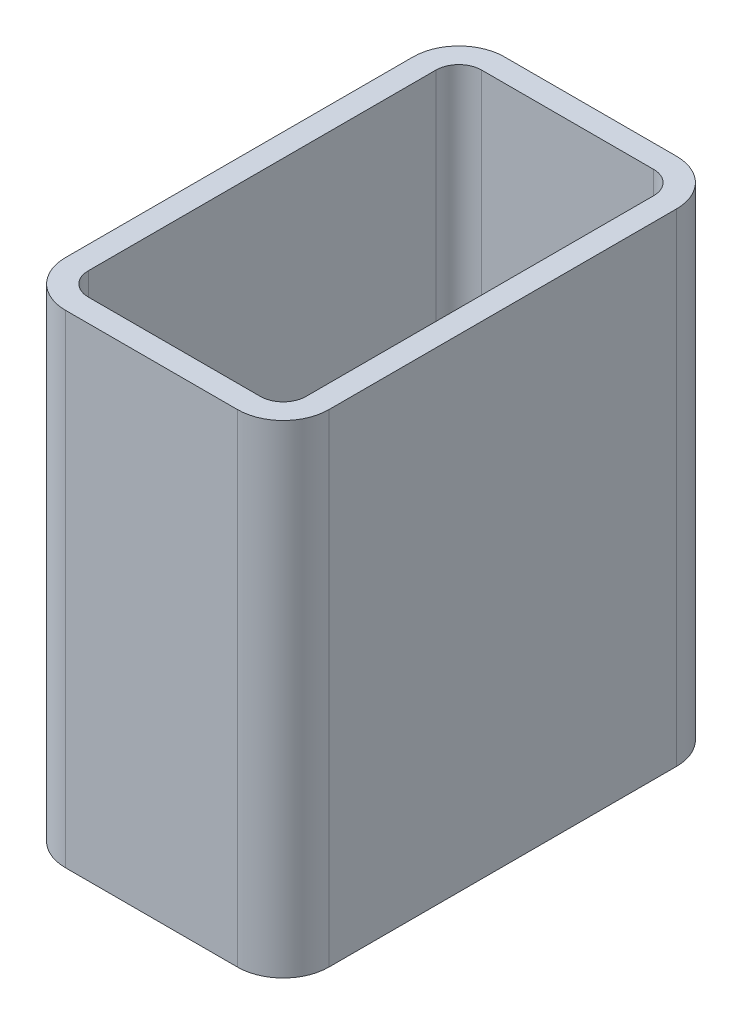
ISO-10303-21;
HEADER;
FILE_DESCRIPTION(('STEP AP214'),'2;1');
FILE_NAME('part.step','',(''),(''),'','','');
FILE_SCHEMA(('AUTOMOTIVE_DESIGN { 1 0 10303 214 1 1 1 1 }'));
ENDSEC;
DATA;
#1=APPLICATION_CONTEXT('core data for automotive mechanical design processes');
#2=APPLICATION_PROTOCOL_DEFINITION('international standard','automotive_design',2000,#1);
#3=PRODUCT_CONTEXT('',#1,'mechanical');
#4=PRODUCT('Part','Part','',(#3));
#5=PRODUCT_RELATED_PRODUCT_CATEGORY('part','',(#4));
#6=PRODUCT_DEFINITION_FORMATION('','',#4);
#7=PRODUCT_DEFINITION_CONTEXT('part definition',#1,'design');
#8=PRODUCT_DEFINITION('design','',#6,#7);
#9=PRODUCT_DEFINITION_SHAPE('','',#8);
#10=(LENGTH_UNIT() NAMED_UNIT(*) SI_UNIT(.MILLI.,.METRE.));
#11=(NAMED_UNIT(*) PLANE_ANGLE_UNIT() SI_UNIT($,.RADIAN.));
#12=(NAMED_UNIT(*) SI_UNIT($,.STERADIAN.) SOLID_ANGLE_UNIT());
#13=UNCERTAINTY_MEASURE_WITH_UNIT(LENGTH_MEASURE(1.E-05),#10,'distance_accuracy_value','');
#14=(GEOMETRIC_REPRESENTATION_CONTEXT(3) GLOBAL_UNCERTAINTY_ASSIGNED_CONTEXT((#13)) GLOBAL_UNIT_ASSIGNED_CONTEXT((#10,
#11,#12)) REPRESENTATION_CONTEXT('',''));
#15=CARTESIAN_POINT('',(0.,0.,0.));
#16=DIRECTION('',(0.,0.,1.));
#17=DIRECTION('',(1.,0.,0.));
#18=AXIS2_PLACEMENT_3D('',#15,#16,#17);
#19=CARTESIAN_POINT('',(5.2,55.,44.8));
#20=DIRECTION('',(0.,-1.,0.));
#21=DIRECTION('',(0.,0.,-1.));
#22=AXIS2_PLACEMENT_3D('',#19,#20,#21);
#23=CYLINDRICAL_SURFACE('',#22,5.2);
#24=CARTESIAN_POINT('',(5.2,0.,44.8));
#25=DIRECTION('',(0.,1.,0.));
#26=DIRECTION('',(0.,0.,1.));
#27=AXIS2_PLACEMENT_3D('',#24,#25,#26);
#28=CIRCLE('',#27,5.2);
#29=CARTESIAN_POINT('',(0.,0.,44.8));
#30=VERTEX_POINT('',#29);
#31=CARTESIAN_POINT('',(5.2,0.,50.));
#32=VERTEX_POINT('',#31);
#33=EDGE_CURVE('E235',#30,#32,#28,.T.);
#34=ORIENTED_EDGE('',*,*,#33,.T.);
#35=DIRECTION('',(0.,-1.,0.));
#36=VECTOR('',#35,1.);
#37=CARTESIAN_POINT('',(5.2,55.,50.));
#38=LINE('',#37,#36);
#39=CARTESIAN_POINT('',(5.2,55.,50.));
#40=VERTEX_POINT('',#39);
#41=EDGE_CURVE('E12',#40,#32,#38,.T.);
#42=ORIENTED_EDGE('',*,*,#41,.F.);
#43=CARTESIAN_POINT('',(5.2,55.,44.8));
#44=DIRECTION('',(0.,1.,0.));
#45=DIRECTION('',(0.,0.,1.));
#46=AXIS2_PLACEMENT_3D('',#43,#44,#45);
#47=CIRCLE('',#46,5.2);
#48=CARTESIAN_POINT('',(0.,55.,44.8));
#49=VERTEX_POINT('',#48);
#50=EDGE_CURVE('E313',#49,#40,#47,.T.);
#51=ORIENTED_EDGE('',*,*,#50,.F.);
#52=DIRECTION('',(0.,-1.,0.));
#53=VECTOR('',#52,1.);
#54=CARTESIAN_POINT('',(0.,55.,44.8));
#55=LINE('',#54,#53);
#56=EDGE_CURVE('E250',#49,#30,#55,.T.);
#57=ORIENTED_EDGE('',*,*,#56,.T.);
#58=EDGE_LOOP('',(#34,#42,#51,#57));
#59=FACE_BOUND('',#58,.T.);
#60=ADVANCED_FACE('F63',(#59),#23,.T.);
#61=CARTESIAN_POINT('',(5.2,55.,50.));
#62=DIRECTION('',(0.,0.,-1.));
#63=DIRECTION('',(-1.,0.,0.));
#64=AXIS2_PLACEMENT_3D('',#61,#62,#63);
#65=PLANE('',#64);
#66=DIRECTION('',(1.,0.,0.));
#67=VECTOR('',#66,1.);
#68=CARTESIAN_POINT('',(5.2,0.,50.));
#69=LINE('',#68,#67);
#70=CARTESIAN_POINT('',(24.8,0.,50.));
#71=VERTEX_POINT('',#70);
#72=EDGE_CURVE('E238',#32,#71,#69,.T.);
#73=ORIENTED_EDGE('',*,*,#72,.T.);
#74=DIRECTION('',(0.,-1.,0.));
#75=VECTOR('',#74,1.);
#76=CARTESIAN_POINT('',(24.8,55.,50.));
#77=LINE('',#76,#75);
#78=CARTESIAN_POINT('',(24.8,55.,50.));
#79=VERTEX_POINT('',#78);
#80=EDGE_CURVE('E73',#79,#71,#77,.T.);
#81=ORIENTED_EDGE('',*,*,#80,.F.);
#82=DIRECTION('',(1.,0.,0.));
#83=VECTOR('',#82,1.);
#84=CARTESIAN_POINT('',(5.2,55.,50.));
#85=LINE('',#84,#83);
#86=EDGE_CURVE('E315',#40,#79,#85,.T.);
#87=ORIENTED_EDGE('',*,*,#86,.F.);
#88=ORIENTED_EDGE('',*,*,#41,.T.);
#89=EDGE_LOOP('',(#73,#81,#87,#88));
#90=FACE_BOUND('',#89,.T.);
#91=ADVANCED_FACE('F350',(#90),#65,.F.);
#92=CARTESIAN_POINT('',(24.8,55.,44.8));
#93=DIRECTION('',(0.,-1.,0.));
#94=DIRECTION('',(0.,0.,-1.));
#95=AXIS2_PLACEMENT_3D('',#92,#93,#94);
#96=CYLINDRICAL_SURFACE('',#95,5.2);
#97=CARTESIAN_POINT('',(24.8,0.,44.8));
#98=DIRECTION('',(0.,1.,0.));
#99=DIRECTION('',(0.,0.,1.));
#100=AXIS2_PLACEMENT_3D('',#97,#98,#99);
#101=CIRCLE('',#100,5.2);
#102=CARTESIAN_POINT('',(30.,0.,44.8));
#103=VERTEX_POINT('',#102);
#104=EDGE_CURVE('E240',#71,#103,#101,.T.);
#105=ORIENTED_EDGE('',*,*,#104,.T.);
#106=DIRECTION('',(0.,-1.,0.));
#107=VECTOR('',#106,1.);
#108=CARTESIAN_POINT('',(30.,55.,44.8));
#109=LINE('',#108,#107);
#110=CARTESIAN_POINT('',(30.,55.,44.8));
#111=VERTEX_POINT('',#110);
#112=EDGE_CURVE('E257',#111,#103,#109,.T.);
#113=ORIENTED_EDGE('',*,*,#112,.F.);
#114=CARTESIAN_POINT('',(24.8,55.,44.8));
#115=DIRECTION('',(0.,1.,0.));
#116=DIRECTION('',(0.,0.,1.));
#117=AXIS2_PLACEMENT_3D('',#114,#115,#116);
#118=CIRCLE('',#117,5.2);
#119=EDGE_CURVE('E317',#79,#111,#118,.T.);
#120=ORIENTED_EDGE('',*,*,#119,.F.);
#121=ORIENTED_EDGE('',*,*,#80,.T.);
#122=EDGE_LOOP('',(#105,#113,#120,#121));
#123=FACE_BOUND('',#122,.T.);
#124=ADVANCED_FACE('F355',(#123),#96,.T.);
#125=CARTESIAN_POINT('',(30.,55.,5.2));
#126=DIRECTION('',(-1.,0.,0.));
#127=DIRECTION('',(0.,0.,1.));
#128=AXIS2_PLACEMENT_3D('',#125,#126,#127);
#129=PLANE('',#128);
#130=DIRECTION('',(0.,0.,-1.));
#131=VECTOR('',#130,1.);
#132=CARTESIAN_POINT('',(30.,0.,5.2));
#133=LINE('',#132,#131);
#134=CARTESIAN_POINT('',(30.,0.,5.2));
#135=VERTEX_POINT('',#134);
#136=EDGE_CURVE('E242',#103,#135,#133,.T.);
#137=ORIENTED_EDGE('',*,*,#136,.T.);
#138=DIRECTION('',(0.,-1.,0.));
#139=VECTOR('',#138,1.);
#140=CARTESIAN_POINT('',(30.,55.,5.2));
#141=LINE('',#140,#139);
#142=CARTESIAN_POINT('',(30.,55.,5.2));
#143=VERTEX_POINT('',#142);
#144=EDGE_CURVE('E254',#143,#135,#141,.T.);
#145=ORIENTED_EDGE('',*,*,#144,.F.);
#146=DIRECTION('',(0.,0.,-1.));
#147=VECTOR('',#146,1.);
#148=CARTESIAN_POINT('',(30.,55.,5.2));
#149=LINE('',#148,#147);
#150=EDGE_CURVE('E319',#111,#143,#149,.T.);
#151=ORIENTED_EDGE('',*,*,#150,.F.);
#152=ORIENTED_EDGE('',*,*,#112,.T.);
#153=EDGE_LOOP('',(#137,#145,#151,#152));
#154=FACE_BOUND('',#153,.T.);
#155=ADVANCED_FACE('F325',(#154),#129,.F.);
#156=CARTESIAN_POINT('',(24.8,55.,5.2));
#157=DIRECTION('',(0.,-1.,0.));
#158=DIRECTION('',(0.,0.,-1.));
#159=AXIS2_PLACEMENT_3D('',#156,#157,#158);
#160=CYLINDRICAL_SURFACE('',#159,5.2);
#161=CARTESIAN_POINT('',(24.8,0.,5.2));
#162=DIRECTION('',(0.,1.,0.));
#163=DIRECTION('',(0.,0.,1.));
#164=AXIS2_PLACEMENT_3D('',#161,#162,#163);
#165=CIRCLE('',#164,5.2);
#166=CARTESIAN_POINT('',(24.8,0.,0.));
#167=VERTEX_POINT('',#166);
#168=EDGE_CURVE('E244',#135,#167,#165,.T.);
#169=ORIENTED_EDGE('',*,*,#168,.T.);
#170=DIRECTION('',(0.,-1.,0.));
#171=VECTOR('',#170,1.);
#172=CARTESIAN_POINT('',(24.8,55.,0.));
#173=LINE('',#172,#171);
#174=CARTESIAN_POINT('',(24.8,55.,0.));
#175=VERTEX_POINT('',#174);
#176=EDGE_CURVE('E202',#175,#167,#173,.T.);
#177=ORIENTED_EDGE('',*,*,#176,.F.);
#178=CARTESIAN_POINT('',(24.8,55.,5.2));
#179=DIRECTION('',(0.,1.,0.));
#180=DIRECTION('',(0.,0.,1.));
#181=AXIS2_PLACEMENT_3D('',#178,#179,#180);
#182=CIRCLE('',#181,5.2);
#183=EDGE_CURVE('E193',#143,#175,#182,.T.);
#184=ORIENTED_EDGE('',*,*,#183,.F.);
#185=ORIENTED_EDGE('',*,*,#144,.T.);
#186=EDGE_LOOP('',(#169,#177,#184,#185));
#187=FACE_BOUND('',#186,.T.);
#188=ADVANCED_FACE('F329',(#187),#160,.T.);
#189=CARTESIAN_POINT('',(24.8,55.,0.));
#190=DIRECTION('',(0.,0.,1.));
#191=DIRECTION('',(1.,0.,0.));
#192=AXIS2_PLACEMENT_3D('',#189,#190,#191);
#193=PLANE('',#192);
#194=DIRECTION('',(-1.,0.,0.));
#195=VECTOR('',#194,1.);
#196=CARTESIAN_POINT('',(24.8,0.,0.));
#197=LINE('',#196,#195);
#198=CARTESIAN_POINT('',(5.2,0.,0.));
#199=VERTEX_POINT('',#198);
#200=EDGE_CURVE('E201',#167,#199,#197,.T.);
#201=ORIENTED_EDGE('',*,*,#200,.T.);
#202=DIRECTION('',(0.,-1.,0.));
#203=VECTOR('',#202,1.);
#204=CARTESIAN_POINT('',(5.2,55.,0.));
#205=LINE('',#204,#203);
#206=CARTESIAN_POINT('',(5.2,55.,0.));
#207=VERTEX_POINT('',#206);
#208=EDGE_CURVE('E198',#207,#199,#205,.T.);
#209=ORIENTED_EDGE('',*,*,#208,.F.);
#210=DIRECTION('',(-1.,0.,0.));
#211=VECTOR('',#210,1.);
#212=CARTESIAN_POINT('',(24.8,55.,0.));
#213=LINE('',#212,#211);
#214=EDGE_CURVE('E187',#175,#207,#213,.T.);
#215=ORIENTED_EDGE('',*,*,#214,.F.);
#216=ORIENTED_EDGE('',*,*,#176,.T.);
#217=EDGE_LOOP('',(#201,#209,#215,#216));
#218=FACE_BOUND('',#217,.T.);
#219=ADVANCED_FACE('F199',(#218),#193,.F.);
#220=CARTESIAN_POINT('',(5.2,55.,5.2));
#221=DIRECTION('',(0.,-1.,0.));
#222=DIRECTION('',(0.,0.,-1.));
#223=AXIS2_PLACEMENT_3D('',#220,#221,#222);
#224=CYLINDRICAL_SURFACE('',#223,5.2);
#225=CARTESIAN_POINT('',(5.2,0.,5.2));
#226=DIRECTION('',(0.,1.,0.));
#227=DIRECTION('',(0.,0.,1.));
#228=AXIS2_PLACEMENT_3D('',#225,#226,#227);
#229=CIRCLE('',#228,5.2);
#230=CARTESIAN_POINT('',(0.,0.,5.2));
#231=VERTEX_POINT('',#230);
#232=EDGE_CURVE('E135',#199,#231,#229,.T.);
#233=ORIENTED_EDGE('',*,*,#232,.T.);
#234=DIRECTION('',(0.,-1.,0.));
#235=VECTOR('',#234,1.);
#236=CARTESIAN_POINT('',(0.,55.,5.2));
#237=LINE('',#236,#235);
#238=CARTESIAN_POINT('',(0.,55.,5.2));
#239=VERTEX_POINT('',#238);
#240=EDGE_CURVE('E203',#239,#231,#237,.T.);
#241=ORIENTED_EDGE('',*,*,#240,.F.);
#242=CARTESIAN_POINT('',(5.2,55.,5.2));
#243=DIRECTION('',(0.,1.,0.));
#244=DIRECTION('',(0.,0.,1.));
#245=AXIS2_PLACEMENT_3D('',#242,#243,#244);
#246=CIRCLE('',#245,5.2);
#247=EDGE_CURVE('E191',#207,#239,#246,.T.);
#248=ORIENTED_EDGE('',*,*,#247,.F.);
#249=ORIENTED_EDGE('',*,*,#208,.T.);
#250=EDGE_LOOP('',(#233,#241,#248,#249));
#251=FACE_BOUND('',#250,.T.);
#252=ADVANCED_FACE('F205',(#251),#224,.T.);
#253=CARTESIAN_POINT('',(24.8,55.,44.8));
#254=DIRECTION('',(0.,-1.,0.));
#255=DIRECTION('',(0.,0.,-1.));
#256=AXIS2_PLACEMENT_3D('',#253,#254,#255);
#257=CYLINDRICAL_SURFACE('',#256,2.6);
#258=CARTESIAN_POINT('',(24.8,0.,44.8));
#259=DIRECTION('',(0.,1.,0.));
#260=DIRECTION('',(0.,0.,1.));
#261=AXIS2_PLACEMENT_3D('',#258,#259,#260);
#262=CIRCLE('',#261,2.6);
#263=CARTESIAN_POINT('',(24.8,0.,47.4));
#264=VERTEX_POINT('',#263);
#265=CARTESIAN_POINT('',(27.4,0.,44.8));
#266=VERTEX_POINT('',#265);
#267=EDGE_CURVE('E211',#264,#266,#262,.T.);
#268=ORIENTED_EDGE('',*,*,#267,.F.);
#269=DIRECTION('',(0.,-1.,0.));
#270=VECTOR('',#269,1.);
#271=CARTESIAN_POINT('',(24.8,55.,47.4));
#272=LINE('',#271,#270);
#273=CARTESIAN_POINT('',(24.8,55.,47.4));
#274=VERTEX_POINT('',#273);
#275=EDGE_CURVE('E67',#274,#264,#272,.T.);
#276=ORIENTED_EDGE('',*,*,#275,.F.);
#277=CARTESIAN_POINT('',(24.8,55.,44.8));
#278=DIRECTION('',(0.,1.,0.));
#279=DIRECTION('',(0.,0.,1.));
#280=AXIS2_PLACEMENT_3D('',#277,#278,#279);
#281=CIRCLE('',#280,2.6);
#282=CARTESIAN_POINT('',(27.4,55.,44.8));
#283=VERTEX_POINT('',#282);
#284=EDGE_CURVE('E249',#274,#283,#281,.T.);
#285=ORIENTED_EDGE('',*,*,#284,.T.);
#286=DIRECTION('',(0.,-1.,0.));
#287=VECTOR('',#286,1.);
#288=CARTESIAN_POINT('',(27.4,55.,44.8));
#289=LINE('',#288,#287);
#290=EDGE_CURVE('E207',#283,#266,#289,.T.);
#291=ORIENTED_EDGE('',*,*,#290,.T.);
#292=EDGE_LOOP('',(#268,#276,#285,#291));
#293=FACE_BOUND('',#292,.T.);
#294=ADVANCED_FACE('F65',(#293),#257,.F.);
#295=CARTESIAN_POINT('',(5.2,55.,47.4));
#296=DIRECTION('',(0.,0.,-1.));
#297=DIRECTION('',(-1.,0.,0.));
#298=AXIS2_PLACEMENT_3D('',#295,#296,#297);
#299=PLANE('',#298);
#300=DIRECTION('',(1.,0.,0.));
#301=VECTOR('',#300,1.);
#302=CARTESIAN_POINT('',(5.2,0.,47.4));
#303=LINE('',#302,#301);
#304=CARTESIAN_POINT('',(5.2,0.,47.4));
#305=VERTEX_POINT('',#304);
#306=EDGE_CURVE('E214',#305,#264,#303,.T.);
#307=ORIENTED_EDGE('',*,*,#306,.F.);
#308=DIRECTION('',(0.,-1.,0.));
#309=VECTOR('',#308,1.);
#310=CARTESIAN_POINT('',(5.2,55.,47.4));
#311=LINE('',#310,#309);
#312=CARTESIAN_POINT('',(5.2,55.,47.4));
#313=VERTEX_POINT('',#312);
#314=EDGE_CURVE('E272',#313,#305,#311,.T.);
#315=ORIENTED_EDGE('',*,*,#314,.F.);
#316=DIRECTION('',(1.,0.,0.));
#317=VECTOR('',#316,1.);
#318=CARTESIAN_POINT('',(5.2,55.,47.4));
#319=LINE('',#318,#317);
#320=EDGE_CURVE('E281',#313,#274,#319,.T.);
#321=ORIENTED_EDGE('',*,*,#320,.T.);
#322=ORIENTED_EDGE('',*,*,#275,.T.);
#323=EDGE_LOOP('',(#307,#315,#321,#322));
#324=FACE_BOUND('',#323,.T.);
#325=ADVANCED_FACE('F279',(#324),#299,.T.);
#326=CARTESIAN_POINT('',(5.2,55.,44.8));
#327=DIRECTION('',(0.,-1.,0.));
#328=DIRECTION('',(0.,0.,-1.));
#329=AXIS2_PLACEMENT_3D('',#326,#327,#328);
#330=CYLINDRICAL_SURFACE('',#329,2.6);
#331=CARTESIAN_POINT('',(5.2,0.,44.8));
#332=DIRECTION('',(0.,1.,0.));
#333=DIRECTION('',(0.,0.,1.));
#334=AXIS2_PLACEMENT_3D('',#331,#332,#333);
#335=CIRCLE('',#334,2.6);
#336=CARTESIAN_POINT('',(2.6,0.,44.8));
#337=VERTEX_POINT('',#336);
#338=EDGE_CURVE('E217',#337,#305,#335,.T.);
#339=ORIENTED_EDGE('',*,*,#338,.F.);
#340=DIRECTION('',(0.,-1.,0.));
#341=VECTOR('',#340,1.);
#342=CARTESIAN_POINT('',(2.6,55.,44.8));
#343=LINE('',#342,#341);
#344=CARTESIAN_POINT('',(2.6,55.,44.8));
#345=VERTEX_POINT('',#344);
#346=EDGE_CURVE('E271',#345,#337,#343,.T.);
#347=ORIENTED_EDGE('',*,*,#346,.F.);
#348=CARTESIAN_POINT('',(5.2,55.,44.8));
#349=DIRECTION('',(0.,1.,0.));
#350=DIRECTION('',(0.,0.,1.));
#351=AXIS2_PLACEMENT_3D('',#348,#349,#350);
#352=CIRCLE('',#351,2.6);
#353=EDGE_CURVE('E289',#345,#313,#352,.T.);
#354=ORIENTED_EDGE('',*,*,#353,.T.);
#355=ORIENTED_EDGE('',*,*,#314,.T.);
#356=EDGE_LOOP('',(#339,#347,#354,#355));
#357=FACE_BOUND('',#356,.T.);
#358=ADVANCED_FACE('F287',(#357),#330,.F.);
#359=CARTESIAN_POINT('',(2.6,55.,44.8));
#360=DIRECTION('',(1.,0.,0.));
#361=DIRECTION('',(0.,0.,-1.));
#362=AXIS2_PLACEMENT_3D('',#359,#360,#361);
#363=PLANE('',#362);
#364=DIRECTION('',(0.,0.,1.));
#365=VECTOR('',#364,1.);
#366=CARTESIAN_POINT('',(2.6,0.,44.8));
#367=LINE('',#366,#365);
#368=CARTESIAN_POINT('',(2.6,0.,5.2));
#369=VERTEX_POINT('',#368);
#370=EDGE_CURVE('E220',#369,#337,#367,.T.);
#371=ORIENTED_EDGE('',*,*,#370,.F.);
#372=DIRECTION('',(0.,-1.,0.));
#373=VECTOR('',#372,1.);
#374=CARTESIAN_POINT('',(2.6,55.,5.2));
#375=LINE('',#374,#373);
#376=CARTESIAN_POINT('',(2.6,55.,5.2));
#377=VERTEX_POINT('',#376);
#378=EDGE_CURVE('E269',#377,#369,#375,.T.);
#379=ORIENTED_EDGE('',*,*,#378,.F.);
#380=DIRECTION('',(0.,0.,1.));
#381=VECTOR('',#380,1.);
#382=CARTESIAN_POINT('',(2.6,55.,44.8));
#383=LINE('',#382,#381);
#384=EDGE_CURVE('E295',#377,#345,#383,.T.);
#385=ORIENTED_EDGE('',*,*,#384,.T.);
#386=ORIENTED_EDGE('',*,*,#346,.T.);
#387=EDGE_LOOP('',(#371,#379,#385,#386));
#388=FACE_BOUND('',#387,.T.);
#389=ADVANCED_FACE('F298',(#388),#363,.T.);
#390=CARTESIAN_POINT('',(5.2,55.,5.2));
#391=DIRECTION('',(0.,-1.,0.));
#392=DIRECTION('',(0.,0.,-1.));
#393=AXIS2_PLACEMENT_3D('',#390,#391,#392);
#394=CYLINDRICAL_SURFACE('',#393,2.6);
#395=CARTESIAN_POINT('',(5.2,0.,5.2));
#396=DIRECTION('',(0.,1.,0.));
#397=DIRECTION('',(0.,0.,1.));
#398=AXIS2_PLACEMENT_3D('',#395,#396,#397);
#399=CIRCLE('',#398,2.6);
#400=CARTESIAN_POINT('',(5.2,0.,2.6));
#401=VERTEX_POINT('',#400);
#402=EDGE_CURVE('E223',#401,#369,#399,.T.);
#403=ORIENTED_EDGE('',*,*,#402,.F.);
#404=DIRECTION('',(0.,-1.,0.));
#405=VECTOR('',#404,1.);
#406=CARTESIAN_POINT('',(5.2,55.,2.6));
#407=LINE('',#406,#405);
#408=CARTESIAN_POINT('',(5.2,55.,2.6));
#409=VERTEX_POINT('',#408);
#410=EDGE_CURVE('E267',#409,#401,#407,.T.);
#411=ORIENTED_EDGE('',*,*,#410,.F.);
#412=CARTESIAN_POINT('',(5.2,55.,5.2));
#413=DIRECTION('',(0.,1.,0.));
#414=DIRECTION('',(0.,0.,1.));
#415=AXIS2_PLACEMENT_3D('',#412,#413,#414);
#416=CIRCLE('',#415,2.6);
#417=EDGE_CURVE('E299',#409,#377,#416,.T.);
#418=ORIENTED_EDGE('',*,*,#417,.T.);
#419=ORIENTED_EDGE('',*,*,#378,.T.);
#420=EDGE_LOOP('',(#403,#411,#418,#419));
#421=FACE_BOUND('',#420,.T.);
#422=ADVANCED_FACE('F366',(#421),#394,.F.);
#423=CARTESIAN_POINT('',(24.8,55.,2.6));
#424=DIRECTION('',(0.,0.,1.));
#425=DIRECTION('',(1.,0.,0.));
#426=AXIS2_PLACEMENT_3D('',#423,#424,#425);
#427=PLANE('',#426);
#428=DIRECTION('',(-1.,0.,0.));
#429=VECTOR('',#428,1.);
#430=CARTESIAN_POINT('',(24.8,0.,2.6));
#431=LINE('',#430,#429);
#432=CARTESIAN_POINT('',(24.8,0.,2.6));
#433=VERTEX_POINT('',#432);
#434=EDGE_CURVE('E226',#433,#401,#431,.T.);
#435=ORIENTED_EDGE('',*,*,#434,.F.);
#436=DIRECTION('',(0.,-1.,0.));
#437=VECTOR('',#436,1.);
#438=CARTESIAN_POINT('',(24.8,55.,2.6));
#439=LINE('',#438,#437);
#440=CARTESIAN_POINT('',(24.8,55.,2.6));
#441=VERTEX_POINT('',#440);
#442=EDGE_CURVE('E265',#441,#433,#439,.T.);
#443=ORIENTED_EDGE('',*,*,#442,.F.);
#444=DIRECTION('',(-1.,0.,0.));
#445=VECTOR('',#444,1.);
#446=CARTESIAN_POINT('',(24.8,55.,2.6));
#447=LINE('',#446,#445);
#448=EDGE_CURVE('E301',#441,#409,#447,.T.);
#449=ORIENTED_EDGE('',*,*,#448,.T.);
#450=ORIENTED_EDGE('',*,*,#410,.T.);
#451=EDGE_LOOP('',(#435,#443,#449,#450));
#452=FACE_BOUND('',#451,.T.);
#453=ADVANCED_FACE('F362',(#452),#427,.T.);
#454=CARTESIAN_POINT('',(24.8,55.,5.2));
#455=DIRECTION('',(0.,-1.,0.));
#456=DIRECTION('',(0.,0.,-1.));
#457=AXIS2_PLACEMENT_3D('',#454,#455,#456);
#458=CYLINDRICAL_SURFACE('',#457,2.6);
#459=CARTESIAN_POINT('',(24.8,0.,5.2));
#460=DIRECTION('',(0.,1.,0.));
#461=DIRECTION('',(0.,0.,1.));
#462=AXIS2_PLACEMENT_3D('',#459,#460,#461);
#463=CIRCLE('',#462,2.6);
#464=CARTESIAN_POINT('',(27.4,0.,5.2));
#465=VERTEX_POINT('',#464);
#466=EDGE_CURVE('E229',#465,#433,#463,.T.);
#467=ORIENTED_EDGE('',*,*,#466,.F.);
#468=DIRECTION('',(0.,-1.,0.));
#469=VECTOR('',#468,1.);
#470=CARTESIAN_POINT('',(27.4,55.,5.2));
#471=LINE('',#470,#469);
#472=CARTESIAN_POINT('',(27.4,55.,5.2));
#473=VERTEX_POINT('',#472);
#474=EDGE_CURVE('E263',#473,#465,#471,.T.);
#475=ORIENTED_EDGE('',*,*,#474,.F.);
#476=CARTESIAN_POINT('',(24.8,55.,5.2));
#477=DIRECTION('',(0.,1.,0.));
#478=DIRECTION('',(0.,0.,1.));
#479=AXIS2_PLACEMENT_3D('',#476,#477,#478);
#480=CIRCLE('',#479,2.6);
#481=EDGE_CURVE('E307',#473,#441,#480,.T.);
#482=ORIENTED_EDGE('',*,*,#481,.T.);
#483=ORIENTED_EDGE('',*,*,#442,.T.);
#484=EDGE_LOOP('',(#467,#475,#482,#483));
#485=FACE_BOUND('',#484,.T.);
#486=ADVANCED_FACE('F344',(#485),#458,.F.);
#487=CARTESIAN_POINT('',(27.4,55.,5.2));
#488=DIRECTION('',(-1.,0.,0.));
#489=DIRECTION('',(0.,0.,1.));
#490=AXIS2_PLACEMENT_3D('',#487,#488,#489);
#491=PLANE('',#490);
#492=DIRECTION('',(0.,0.,-1.));
#493=VECTOR('',#492,1.);
#494=CARTESIAN_POINT('',(27.4,0.,5.2));
#495=LINE('',#494,#493);
#496=EDGE_CURVE('E232',#266,#465,#495,.T.);
#497=ORIENTED_EDGE('',*,*,#496,.F.);
#498=ORIENTED_EDGE('',*,*,#290,.F.);
#499=DIRECTION('',(0.,0.,-1.));
#500=VECTOR('',#499,1.);
#501=CARTESIAN_POINT('',(27.4,55.,5.2));
#502=LINE('',#501,#500);
#503=EDGE_CURVE('E310',#283,#473,#502,.T.);
#504=ORIENTED_EDGE('',*,*,#503,.T.);
#505=ORIENTED_EDGE('',*,*,#474,.T.);
#506=EDGE_LOOP('',(#497,#498,#504,#505));
#507=FACE_BOUND('',#506,.T.);
#508=ADVANCED_FACE('F337',(#507),#491,.T.);
#509=CARTESIAN_POINT('',(0.,55.,44.8));
#510=DIRECTION('',(1.,0.,0.));
#511=DIRECTION('',(0.,0.,-1.));
#512=AXIS2_PLACEMENT_3D('',#509,#510,#511);
#513=PLANE('',#512);
#514=DIRECTION('',(0.,0.,1.));
#515=VECTOR('',#514,1.);
#516=CARTESIAN_POINT('',(0.,0.,44.8));
#517=LINE('',#516,#515);
#518=EDGE_CURVE('E141',#231,#30,#517,.T.);
#519=ORIENTED_EDGE('',*,*,#518,.T.);
#520=ORIENTED_EDGE('',*,*,#56,.F.);
#521=DIRECTION('',(0.,0.,1.));
#522=VECTOR('',#521,1.);
#523=CARTESIAN_POINT('',(0.,55.,44.8));
#524=LINE('',#523,#522);
#525=EDGE_CURVE('E82',#239,#49,#524,.T.);
#526=ORIENTED_EDGE('',*,*,#525,.F.);
#527=ORIENTED_EDGE('',*,*,#240,.T.);
#528=EDGE_LOOP('',(#519,#520,#526,#527));
#529=FACE_BOUND('',#528,.T.);
#530=ADVANCED_FACE('F335',(#529),#513,.F.);
#531=CARTESIAN_POINT('',(5.2,55.,44.8));
#532=DIRECTION('',(0.,1.,0.));
#533=DIRECTION('',(0.,0.,1.));
#534=AXIS2_PLACEMENT_3D('',#531,#532,#533);
#535=PLANE('',#534);
#536=ORIENTED_EDGE('',*,*,#284,.F.);
#537=ORIENTED_EDGE('',*,*,#320,.F.);
#538=ORIENTED_EDGE('',*,*,#353,.F.);
#539=ORIENTED_EDGE('',*,*,#384,.F.);
#540=ORIENTED_EDGE('',*,*,#417,.F.);
#541=ORIENTED_EDGE('',*,*,#448,.F.);
#542=ORIENTED_EDGE('',*,*,#481,.F.);
#543=ORIENTED_EDGE('',*,*,#503,.F.);
#544=EDGE_LOOP('',(#536,#537,#538,#539,#540,#541,#542,#543));
#545=FACE_BOUND('',#544,.T.);
#546=ORIENTED_EDGE('',*,*,#50,.T.);
#547=ORIENTED_EDGE('',*,*,#86,.T.);
#548=ORIENTED_EDGE('',*,*,#119,.T.);
#549=ORIENTED_EDGE('',*,*,#150,.T.);
#550=ORIENTED_EDGE('',*,*,#183,.T.);
#551=ORIENTED_EDGE('',*,*,#214,.T.);
#552=ORIENTED_EDGE('',*,*,#247,.T.);
#553=ORIENTED_EDGE('',*,*,#525,.T.);
#554=EDGE_LOOP('',(#546,#547,#548,#549,#550,#551,#552,#553));
#555=FACE_BOUND('',#554,.T.);
#556=ADVANCED_FACE('F189',(#545,#555),#535,.T.);
#557=CARTESIAN_POINT('',(5.2,0.,44.8));
#558=DIRECTION('',(0.,1.,0.));
#559=DIRECTION('',(0.,0.,1.));
#560=AXIS2_PLACEMENT_3D('',#557,#558,#559);
#561=PLANE('',#560);
#562=ORIENTED_EDGE('',*,*,#267,.T.);
#563=ORIENTED_EDGE('',*,*,#496,.T.);
#564=ORIENTED_EDGE('',*,*,#466,.T.);
#565=ORIENTED_EDGE('',*,*,#434,.T.);
#566=ORIENTED_EDGE('',*,*,#402,.T.);
#567=ORIENTED_EDGE('',*,*,#370,.T.);
#568=ORIENTED_EDGE('',*,*,#338,.T.);
#569=ORIENTED_EDGE('',*,*,#306,.T.);
#570=EDGE_LOOP('',(#562,#563,#564,#565,#566,#567,#568,#569));
#571=FACE_BOUND('',#570,.T.);
#572=ORIENTED_EDGE('',*,*,#33,.F.);
#573=ORIENTED_EDGE('',*,*,#518,.F.);
#574=ORIENTED_EDGE('',*,*,#232,.F.);
#575=ORIENTED_EDGE('',*,*,#200,.F.);
#576=ORIENTED_EDGE('',*,*,#168,.F.);
#577=ORIENTED_EDGE('',*,*,#136,.F.);
#578=ORIENTED_EDGE('',*,*,#104,.F.);
#579=ORIENTED_EDGE('',*,*,#72,.F.);
#580=EDGE_LOOP('',(#572,#573,#574,#575,#576,#577,#578,#579));
#581=FACE_BOUND('',#580,.T.);
#582=ADVANCED_FACE('F284',(#571,#581),#561,.F.);
#583=CLOSED_SHELL('',(#60,#91,#124,#155,#188,#219,#252,#294,#325,#358,#389,#422,#453,#486,#508,
#530,#556,#582));
#584=MANIFOLD_SOLID_BREP('B2',#583);
#585=ADVANCED_BREP_SHAPE_REPRESENTATION('',(#18,#584),#14);
#586=SHAPE_DEFINITION_REPRESENTATION(#9,#585);
ENDSEC;
END-ISO-10303-21;
